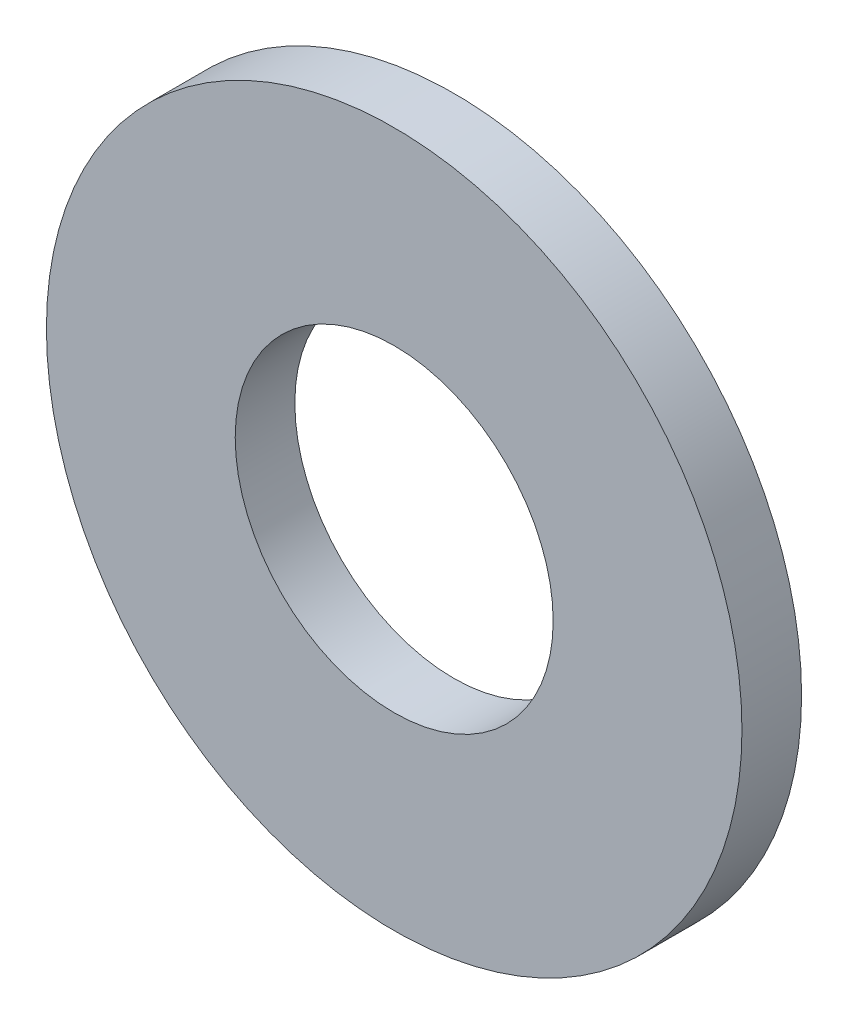
ISO-10303-21;
HEADER;
FILE_DESCRIPTION(('STEP AP214'),'2;1');
FILE_NAME('part.step','',(''),(''),'','','');
FILE_SCHEMA(('AUTOMOTIVE_DESIGN { 1 0 10303 214 1 1 1 1 }'));
ENDSEC;
DATA;
#1=APPLICATION_CONTEXT('core data for automotive mechanical design processes');
#2=APPLICATION_PROTOCOL_DEFINITION('international standard','automotive_design',2000,#1);
#3=PRODUCT_CONTEXT('',#1,'mechanical');
#4=PRODUCT('Part','Part','',(#3));
#5=PRODUCT_RELATED_PRODUCT_CATEGORY('part','',(#4));
#6=PRODUCT_DEFINITION_FORMATION('','',#4);
#7=PRODUCT_DEFINITION_CONTEXT('part definition',#1,'design');
#8=PRODUCT_DEFINITION('design','',#6,#7);
#9=PRODUCT_DEFINITION_SHAPE('','',#8);
#10=(LENGTH_UNIT() NAMED_UNIT(*) SI_UNIT(.MILLI.,.METRE.));
#11=(NAMED_UNIT(*) PLANE_ANGLE_UNIT() SI_UNIT($,.RADIAN.));
#12=(NAMED_UNIT(*) SI_UNIT($,.STERADIAN.) SOLID_ANGLE_UNIT());
#13=UNCERTAINTY_MEASURE_WITH_UNIT(LENGTH_MEASURE(1.E-05),#10,'distance_accuracy_value','');
#14=(GEOMETRIC_REPRESENTATION_CONTEXT(3) GLOBAL_UNCERTAINTY_ASSIGNED_CONTEXT((#13)) GLOBAL_UNIT_ASSIGNED_CONTEXT((#10,
#11,#12)) REPRESENTATION_CONTEXT('',''));
#15=CARTESIAN_POINT('',(0.,0.,0.));
#16=DIRECTION('',(0.,0.,1.));
#17=DIRECTION('',(1.,0.,0.));
#18=AXIS2_PLACEMENT_3D('',#15,#16,#17);
#19=CARTESIAN_POINT('',(0.,0.,0.6));
#20=DIRECTION('',(0.,0.,1.));
#21=DIRECTION('',(1.,0.,0.));
#22=AXIS2_PLACEMENT_3D('',#19,#20,#21);
#23=PLANE('',#22);
#24=CARTESIAN_POINT('',(0.,0.,0.6));
#25=DIRECTION('',(0.,0.,-1.));
#26=DIRECTION('',(-1.,0.,0.));
#27=AXIS2_PLACEMENT_3D('',#24,#25,#26);
#28=CIRCLE('',#27,1.6);
#29=CARTESIAN_POINT('',(-1.6,0.,0.6));
#30=VERTEX_POINT('',#29);
#31=EDGE_CURVE('E27',#30,#30,#28,.T.);
#32=ORIENTED_EDGE('',*,*,#31,.T.);
#33=EDGE_LOOP('',(#32));
#34=FACE_BOUND('',#33,.T.);
#35=CARTESIAN_POINT('',(0.,0.,0.6));
#36=DIRECTION('',(0.,0.,-1.));
#37=DIRECTION('',(-1.,0.,0.));
#38=AXIS2_PLACEMENT_3D('',#35,#36,#37);
#39=CIRCLE('',#38,3.5);
#40=CARTESIAN_POINT('',(-3.5,0.,0.6));
#41=VERTEX_POINT('',#40);
#42=EDGE_CURVE('E18',#41,#41,#39,.T.);
#43=ORIENTED_EDGE('',*,*,#42,.F.);
#44=EDGE_LOOP('',(#43));
#45=FACE_BOUND('',#44,.T.);
#46=ADVANCED_FACE('F15',(#34,#45),#23,.T.);
#47=CARTESIAN_POINT('',(0.,0.,0.6));
#48=DIRECTION('',(0.,0.,-1.));
#49=DIRECTION('',(-1.,0.,0.));
#50=AXIS2_PLACEMENT_3D('',#47,#48,#49);
#51=CYLINDRICAL_SURFACE('',#50,3.5);
#52=CARTESIAN_POINT('',(0.,0.,0.));
#53=DIRECTION('',(0.,0.,-1.));
#54=DIRECTION('',(-1.,0.,0.));
#55=AXIS2_PLACEMENT_3D('',#52,#53,#54);
#56=CIRCLE('',#55,3.5);
#57=CARTESIAN_POINT('',(-3.5,0.,0.));
#58=VERTEX_POINT('',#57);
#59=EDGE_CURVE('E22',#58,#58,#56,.F.);
#60=ORIENTED_EDGE('',*,*,#59,.T.);
#61=EDGE_LOOP('',(#60));
#62=FACE_BOUND('',#61,.T.);
#63=ORIENTED_EDGE('',*,*,#42,.T.);
#64=EDGE_LOOP('',(#63));
#65=FACE_BOUND('',#64,.T.);
#66=ADVANCED_FACE('F35',(#62,#65),#51,.T.);
#67=CARTESIAN_POINT('',(0.,0.,0.6));
#68=DIRECTION('',(0.,0.,-1.));
#69=DIRECTION('',(-1.,0.,0.));
#70=AXIS2_PLACEMENT_3D('',#67,#68,#69);
#71=CYLINDRICAL_SURFACE('',#70,1.6);
#72=CARTESIAN_POINT('',(0.,0.,0.));
#73=DIRECTION('',(0.,0.,-1.));
#74=DIRECTION('',(-1.,0.,0.));
#75=AXIS2_PLACEMENT_3D('',#72,#73,#74);
#76=CIRCLE('',#75,1.6);
#77=CARTESIAN_POINT('',(-1.6,0.,0.));
#78=VERTEX_POINT('',#77);
#79=EDGE_CURVE('E10',#78,#78,#76,.T.);
#80=ORIENTED_EDGE('',*,*,#79,.T.);
#81=EDGE_LOOP('',(#80));
#82=FACE_BOUND('',#81,.T.);
#83=ORIENTED_EDGE('',*,*,#31,.F.);
#84=EDGE_LOOP('',(#83));
#85=FACE_BOUND('',#84,.T.);
#86=ADVANCED_FACE('F42',(#82,#85),#71,.F.);
#87=CARTESIAN_POINT('',(0.,0.,0.));
#88=DIRECTION('',(0.,0.,1.));
#89=DIRECTION('',(1.,0.,0.));
#90=AXIS2_PLACEMENT_3D('',#87,#88,#89);
#91=PLANE('',#90);
#92=ORIENTED_EDGE('',*,*,#79,.F.);
#93=EDGE_LOOP('',(#92));
#94=FACE_BOUND('',#93,.T.);
#95=ORIENTED_EDGE('',*,*,#59,.F.);
#96=EDGE_LOOP('',(#95));
#97=FACE_BOUND('',#96,.T.);
#98=ADVANCED_FACE('F44',(#94,#97),#91,.F.);
#99=CLOSED_SHELL('',(#46,#66,#86,#98));
#100=MANIFOLD_SOLID_BREP('B1',#99);
#101=ADVANCED_BREP_SHAPE_REPRESENTATION('',(#18,#100),#14);
#102=SHAPE_DEFINITION_REPRESENTATION(#9,#101);
ENDSEC;
END-ISO-10303-21;
